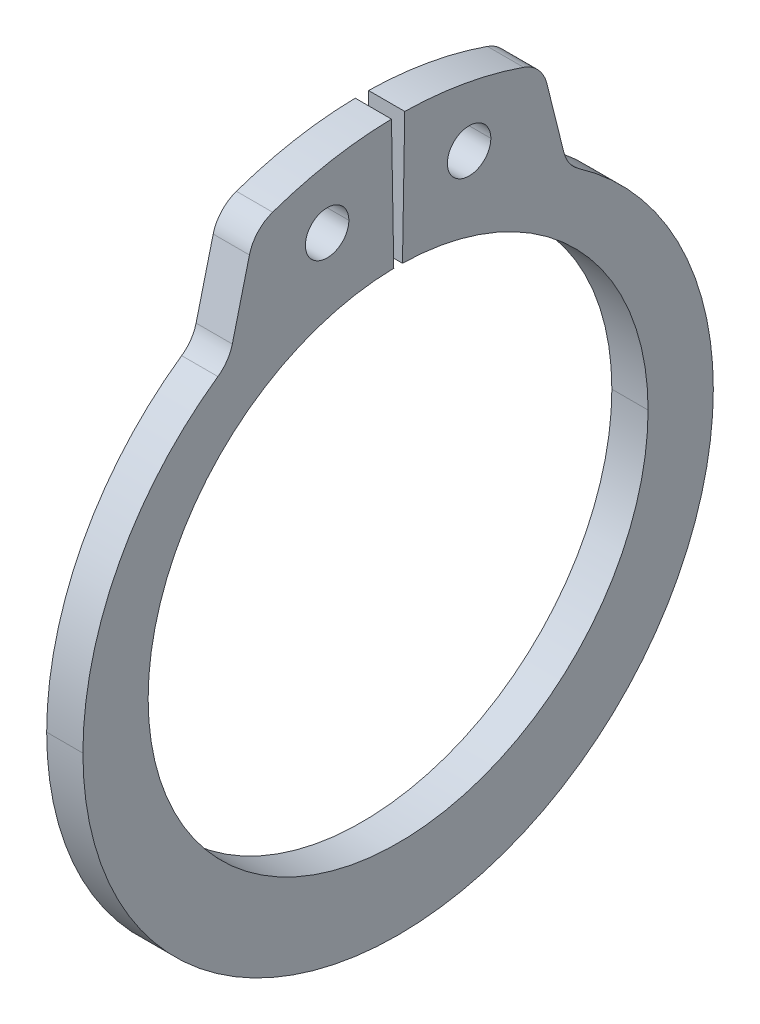
ISO-10303-21;
HEADER;
FILE_DESCRIPTION(('STEP AP214'),'2;1');
FILE_NAME('part.step','',(''),(''),'','','');
FILE_SCHEMA(('AUTOMOTIVE_DESIGN { 1 0 10303 214 1 1 1 1 }'));
ENDSEC;
DATA;
#1=APPLICATION_CONTEXT('core data for automotive mechanical design processes');
#2=APPLICATION_PROTOCOL_DEFINITION('international standard','automotive_design',2000,#1);
#3=PRODUCT_CONTEXT('',#1,'mechanical');
#4=PRODUCT('Part','Part','',(#3));
#5=PRODUCT_RELATED_PRODUCT_CATEGORY('part','',(#4));
#6=PRODUCT_DEFINITION_FORMATION('','',#4);
#7=PRODUCT_DEFINITION_CONTEXT('part definition',#1,'design');
#8=PRODUCT_DEFINITION('design','',#6,#7);
#9=PRODUCT_DEFINITION_SHAPE('','',#8);
#10=(LENGTH_UNIT() NAMED_UNIT(*) SI_UNIT(.MILLI.,.METRE.));
#11=(NAMED_UNIT(*) PLANE_ANGLE_UNIT() SI_UNIT($,.RADIAN.));
#12=(NAMED_UNIT(*) SI_UNIT($,.STERADIAN.) SOLID_ANGLE_UNIT());
#13=UNCERTAINTY_MEASURE_WITH_UNIT(LENGTH_MEASURE(1.E-05),#10,'distance_accuracy_value','');
#14=(GEOMETRIC_REPRESENTATION_CONTEXT(3) GLOBAL_UNCERTAINTY_ASSIGNED_CONTEXT((#13)) GLOBAL_UNIT_ASSIGNED_CONTEXT((#10,
#11,#12)) REPRESENTATION_CONTEXT('',''));
#15=CARTESIAN_POINT('',(0.,0.,0.));
#16=DIRECTION('',(0.,0.,1.));
#17=DIRECTION('',(1.,0.,0.));
#18=AXIS2_PLACEMENT_3D('',#15,#16,#17);
#19=CARTESIAN_POINT('',(0.5,7.55953720484558,-5.54645551751436));
#20=DIRECTION('',(-1.,0.,0.));
#21=DIRECTION('',(0.,0.,1.));
#22=AXIS2_PLACEMENT_3D('',#19,#20,#21);
#23=CYLINDRICAL_SURFACE('',#22,1.);
#24=CARTESIAN_POINT('',(0.5,7.55953720484558,-5.54645551751436));
#25=DIRECTION('',(-1.,0.,0.));
#26=DIRECTION('',(0.,0.,-1.));
#27=AXIS2_PLACEMENT_3D('',#24,#25,#26);
#28=CIRCLE('',#27,1.);
#29=CARTESIAN_POINT('',(0.5,6.73911195964233,-4.97470170945253));
#30=VERTEX_POINT('',#29);
#31=CARTESIAN_POINT('',(0.5,7.31761530924591,-4.57615979123836));
#32=VERTEX_POINT('',#31);
#33=EDGE_CURVE('E221',#30,#32,#28,.T.);
#34=ORIENTED_EDGE('',*,*,#33,.F.);
#35=DIRECTION('',(1.,0.,0.));
#36=VECTOR('',#35,1.);
#37=CARTESIAN_POINT('',(0.5,6.73911195964233,-4.97470170945253));
#38=LINE('',#37,#36);
#39=CARTESIAN_POINT('',(-0.5,6.73911195964233,-4.97470170945253));
#40=VERTEX_POINT('',#39);
#41=EDGE_CURVE('E243',#40,#30,#38,.T.);
#42=ORIENTED_EDGE('',*,*,#41,.F.);
#43=CARTESIAN_POINT('',(-0.5,7.55953720484558,-5.54645551751436));
#44=DIRECTION('',(1.,0.,0.));
#45=DIRECTION('',(0.,0.,-1.));
#46=AXIS2_PLACEMENT_3D('',#43,#44,#45);
#47=CIRCLE('',#46,1.);
#48=CARTESIAN_POINT('',(-0.5,7.31761530924591,-4.57615979123836));
#49=VERTEX_POINT('',#48);
#50=EDGE_CURVE('E269',#49,#40,#47,.T.);
#51=ORIENTED_EDGE('',*,*,#50,.F.);
#52=DIRECTION('',(-1.,0.,0.));
#53=VECTOR('',#52,1.);
#54=CARTESIAN_POINT('',(-0.5,7.31761530924591,-4.57615979123836));
#55=LINE('',#54,#53);
#56=EDGE_CURVE('E188',#32,#49,#55,.T.);
#57=ORIENTED_EDGE('',*,*,#56,.F.);
#58=EDGE_LOOP('',(#34,#42,#51,#57));
#59=FACE_BOUND('',#58,.T.);
#60=ADVANCED_FACE('F16',(#59),#23,.F.);
#61=CARTESIAN_POINT('',(0.5,8.96816184312502,-3.13401869099666));
#62=DIRECTION('',(-1.,0.,0.));
#63=DIRECTION('',(0.,0.,1.));
#64=AXIS2_PLACEMENT_3D('',#61,#62,#63);
#65=CYLINDRICAL_SURFACE('',#64,1.);
#66=CARTESIAN_POINT('',(0.5,8.96816184312502,-3.13401869099666));
#67=DIRECTION('',(1.,0.,0.));
#68=DIRECTION('',(0.,0.,-1.));
#69=AXIS2_PLACEMENT_3D('',#66,#67,#68);
#70=CIRCLE('',#69,1.);
#71=CARTESIAN_POINT('',(0.5,9.21008373872469,-4.10431441727265));
#72=VERTEX_POINT('',#71);
#73=CARTESIAN_POINT('',(0.5,9.91217887924345,-3.46391539531209));
#74=VERTEX_POINT('',#73);
#75=EDGE_CURVE('E210',#72,#74,#70,.T.);
#76=ORIENTED_EDGE('',*,*,#75,.F.);
#77=DIRECTION('',(1.,0.,0.));
#78=VECTOR('',#77,1.);
#79=CARTESIAN_POINT('',(0.5,9.21008373872469,-4.10431441727265));
#80=LINE('',#79,#78);
#81=CARTESIAN_POINT('',(-0.5,9.21008373872469,-4.10431441727265));
#82=VERTEX_POINT('',#81);
#83=EDGE_CURVE('E196',#82,#72,#80,.T.);
#84=ORIENTED_EDGE('',*,*,#83,.F.);
#85=CARTESIAN_POINT('',(-0.5,8.96816184312502,-3.13401869099666));
#86=DIRECTION('',(-1.,0.,0.));
#87=DIRECTION('',(0.,0.,-1.));
#88=AXIS2_PLACEMENT_3D('',#85,#86,#87);
#89=CIRCLE('',#88,1.);
#90=CARTESIAN_POINT('',(-0.5,9.91217887924345,-3.46391539531209));
#91=VERTEX_POINT('',#90);
#92=EDGE_CURVE('E291',#91,#82,#89,.T.);
#93=ORIENTED_EDGE('',*,*,#92,.F.);
#94=DIRECTION('',(-1.,0.,0.));
#95=VECTOR('',#94,1.);
#96=CARTESIAN_POINT('',(0.5,9.91217887924345,-3.46391539531209));
#97=LINE('',#96,#95);
#98=EDGE_CURVE('E27',#74,#91,#97,.T.);
#99=ORIENTED_EDGE('',*,*,#98,.F.);
#100=EDGE_LOOP('',(#76,#84,#93,#99));
#101=FACE_BOUND('',#100,.T.);
#102=ADVANCED_FACE('F211',(#101),#65,.T.);
#103=CARTESIAN_POINT('',(0.5,8.96816184312502,3.13401869099666));
#104=DIRECTION('',(-1.,0.,0.));
#105=DIRECTION('',(0.,0.,1.));
#106=AXIS2_PLACEMENT_3D('',#103,#104,#105);
#107=CYLINDRICAL_SURFACE('',#106,1.);
#108=CARTESIAN_POINT('',(0.5,8.96816184312502,3.13401869099666));
#109=DIRECTION('',(1.,0.,0.));
#110=DIRECTION('',(0.,0.,-1.));
#111=AXIS2_PLACEMENT_3D('',#108,#109,#110);
#112=CIRCLE('',#111,1.);
#113=CARTESIAN_POINT('',(0.5,9.91217887924345,3.46391539531209));
#114=VERTEX_POINT('',#113);
#115=CARTESIAN_POINT('',(0.5,9.21008373872469,4.10431441727265));
#116=VERTEX_POINT('',#115);
#117=EDGE_CURVE('E320',#114,#116,#112,.T.);
#118=ORIENTED_EDGE('',*,*,#117,.F.);
#119=DIRECTION('',(1.,0.,0.));
#120=VECTOR('',#119,1.);
#121=CARTESIAN_POINT('',(0.5,9.91217887924345,3.46391539531209));
#122=LINE('',#121,#120);
#123=CARTESIAN_POINT('',(-0.5,9.91217887924345,3.46391539531209));
#124=VERTEX_POINT('',#123);
#125=EDGE_CURVE('E337',#124,#114,#122,.T.);
#126=ORIENTED_EDGE('',*,*,#125,.F.);
#127=CARTESIAN_POINT('',(-0.5,8.96816184312502,3.13401869099666));
#128=DIRECTION('',(-1.,0.,0.));
#129=DIRECTION('',(0.,0.,-1.));
#130=AXIS2_PLACEMENT_3D('',#127,#128,#129);
#131=CIRCLE('',#130,1.);
#132=CARTESIAN_POINT('',(-0.5,9.21008373872469,4.10431441727265));
#133=VERTEX_POINT('',#132);
#134=EDGE_CURVE('E386',#133,#124,#131,.T.);
#135=ORIENTED_EDGE('',*,*,#134,.F.);
#136=DIRECTION('',(-1.,0.,0.));
#137=VECTOR('',#136,1.);
#138=CARTESIAN_POINT('',(0.5,9.21008373872469,4.10431441727265));
#139=LINE('',#138,#137);
#140=EDGE_CURVE('E311',#116,#133,#139,.T.);
#141=ORIENTED_EDGE('',*,*,#140,.F.);
#142=EDGE_LOOP('',(#118,#126,#135,#141));
#143=FACE_BOUND('',#142,.T.);
#144=ADVANCED_FACE('F610',(#143),#107,.T.);
#145=CARTESIAN_POINT('',(0.5,7.55953720484558,5.54645551751436));
#146=DIRECTION('',(-1.,0.,0.));
#147=DIRECTION('',(0.,0.,1.));
#148=AXIS2_PLACEMENT_3D('',#145,#146,#147);
#149=CYLINDRICAL_SURFACE('',#148,1.);
#150=CARTESIAN_POINT('',(0.5,7.55953720484558,5.54645551751436));
#151=DIRECTION('',(-1.,0.,0.));
#152=DIRECTION('',(0.,0.,-1.));
#153=AXIS2_PLACEMENT_3D('',#150,#151,#152);
#154=CIRCLE('',#153,1.);
#155=CARTESIAN_POINT('',(0.5,7.31761530924591,4.57615979123836));
#156=VERTEX_POINT('',#155);
#157=CARTESIAN_POINT('',(0.5,6.73911195964233,4.97470170945253));
#158=VERTEX_POINT('',#157);
#159=EDGE_CURVE('E260',#156,#158,#154,.T.);
#160=ORIENTED_EDGE('',*,*,#159,.F.);
#161=DIRECTION('',(1.,0.,0.));
#162=VECTOR('',#161,1.);
#163=CARTESIAN_POINT('',(0.5,7.31761530924591,4.57615979123836));
#164=LINE('',#163,#162);
#165=CARTESIAN_POINT('',(-0.5,7.31761530924591,4.57615979123836));
#166=VERTEX_POINT('',#165);
#167=EDGE_CURVE('E314',#166,#156,#164,.T.);
#168=ORIENTED_EDGE('',*,*,#167,.F.);
#169=CARTESIAN_POINT('',(-0.5,7.55953720484558,5.54645551751436));
#170=DIRECTION('',(1.,0.,0.));
#171=DIRECTION('',(0.,0.,-1.));
#172=AXIS2_PLACEMENT_3D('',#169,#170,#171);
#173=CIRCLE('',#172,1.);
#174=CARTESIAN_POINT('',(-0.5,6.73911195964233,4.97470170945253));
#175=VERTEX_POINT('',#174);
#176=EDGE_CURVE('E268',#175,#166,#173,.T.);
#177=ORIENTED_EDGE('',*,*,#176,.F.);
#178=DIRECTION('',(-1.,0.,0.));
#179=VECTOR('',#178,1.);
#180=CARTESIAN_POINT('',(0.5,6.73911195964233,4.97470170945253));
#181=LINE('',#180,#179);
#182=EDGE_CURVE('E42',#158,#175,#181,.T.);
#183=ORIENTED_EDGE('',*,*,#182,.F.);
#184=EDGE_LOOP('',(#160,#168,#177,#183));
#185=FACE_BOUND('',#184,.T.);
#186=ADVANCED_FACE('F18',(#185),#149,.F.);
#187=CARTESIAN_POINT('',(0.5,8.66711980549086,-1.9596288316201));
#188=DIRECTION('',(-1.,0.,0.));
#189=DIRECTION('',(0.,0.,1.));
#190=AXIS2_PLACEMENT_3D('',#187,#188,#189);
#191=CYLINDRICAL_SURFACE('',#190,0.6);
#192=DIRECTION('',(-1.,0.,0.));
#193=VECTOR('',#192,1.);
#194=CARTESIAN_POINT('',(0.5,8.66711980549086,-2.5596288316201));
#195=LINE('',#194,#193);
#196=CARTESIAN_POINT('',(0.5,8.66711980549086,-2.5596288316201));
#197=VERTEX_POINT('',#196);
#198=CARTESIAN_POINT('',(-0.5,8.66711980549086,-2.5596288316201));
#199=VERTEX_POINT('',#198);
#200=EDGE_CURVE('E351',#197,#199,#195,.T.);
#201=ORIENTED_EDGE('',*,*,#200,.F.);
#202=CARTESIAN_POINT('',(0.5,8.66711980549086,-1.9596288316201));
#203=DIRECTION('',(1.,0.,0.));
#204=DIRECTION('',(0.,0.,-1.));
#205=AXIS2_PLACEMENT_3D('',#202,#203,#204);
#206=CIRCLE('',#205,0.6);
#207=CARTESIAN_POINT('',(0.5,8.66711980549086,-1.3596288316201));
#208=VERTEX_POINT('',#207);
#209=EDGE_CURVE('E278',#197,#208,#206,.T.);
#210=ORIENTED_EDGE('',*,*,#209,.T.);
#211=DIRECTION('',(-1.,0.,0.));
#212=VECTOR('',#211,1.);
#213=CARTESIAN_POINT('',(0.5,8.66711980549086,-1.3596288316201));
#214=LINE('',#213,#212);
#215=CARTESIAN_POINT('',(-0.5,8.66711980549086,-1.3596288316201));
#216=VERTEX_POINT('',#215);
#217=EDGE_CURVE('E270',#208,#216,#214,.T.);
#218=ORIENTED_EDGE('',*,*,#217,.T.);
#219=CARTESIAN_POINT('',(-0.5,8.66711980549086,-1.9596288316201));
#220=DIRECTION('',(1.,0.,0.));
#221=DIRECTION('',(0.,0.,-1.));
#222=AXIS2_PLACEMENT_3D('',#219,#220,#221);
#223=CIRCLE('',#222,0.6);
#224=EDGE_CURVE('E327',#199,#216,#223,.T.);
#225=ORIENTED_EDGE('',*,*,#224,.F.);
#226=EDGE_LOOP('',(#201,#210,#218,#225));
#227=FACE_BOUND('',#226,.T.);
#228=ADVANCED_FACE('F609',(#227),#191,.F.);
#229=CARTESIAN_POINT('',(0.5,8.66711980549086,1.9596288316201));
#230=DIRECTION('',(-1.,0.,0.));
#231=DIRECTION('',(0.,0.,1.));
#232=AXIS2_PLACEMENT_3D('',#229,#230,#231);
#233=CYLINDRICAL_SURFACE('',#232,0.6);
#234=DIRECTION('',(-1.,0.,0.));
#235=VECTOR('',#234,1.);
#236=CARTESIAN_POINT('',(0.5,8.66711980549086,1.3596288316201));
#237=LINE('',#236,#235);
#238=CARTESIAN_POINT('',(0.5,8.66711980549086,1.3596288316201));
#239=VERTEX_POINT('',#238);
#240=CARTESIAN_POINT('',(-0.5,8.66711980549086,1.3596288316201));
#241=VERTEX_POINT('',#240);
#242=EDGE_CURVE('E347',#239,#241,#237,.T.);
#243=ORIENTED_EDGE('',*,*,#242,.F.);
#244=CARTESIAN_POINT('',(0.5,8.66711980549086,1.9596288316201));
#245=DIRECTION('',(1.,0.,0.));
#246=DIRECTION('',(0.,0.,-1.));
#247=AXIS2_PLACEMENT_3D('',#244,#245,#246);
#248=CIRCLE('',#247,0.6);
#249=CARTESIAN_POINT('',(0.5,8.66711980549086,2.5596288316201));
#250=VERTEX_POINT('',#249);
#251=EDGE_CURVE('E275',#239,#250,#248,.T.);
#252=ORIENTED_EDGE('',*,*,#251,.T.);
#253=DIRECTION('',(-1.,0.,0.));
#254=VECTOR('',#253,1.);
#255=CARTESIAN_POINT('',(0.5,8.66711980549086,2.5596288316201));
#256=LINE('',#255,#254);
#257=CARTESIAN_POINT('',(-0.5,8.66711980549086,2.5596288316201));
#258=VERTEX_POINT('',#257);
#259=EDGE_CURVE('E244',#250,#258,#256,.T.);
#260=ORIENTED_EDGE('',*,*,#259,.T.);
#261=CARTESIAN_POINT('',(-0.5,8.66711980549086,1.9596288316201));
#262=DIRECTION('',(1.,0.,0.));
#263=DIRECTION('',(0.,0.,-1.));
#264=AXIS2_PLACEMENT_3D('',#261,#262,#263);
#265=CIRCLE('',#264,0.6);
#266=EDGE_CURVE('E367',#241,#258,#265,.T.);
#267=ORIENTED_EDGE('',*,*,#266,.F.);
#268=EDGE_LOOP('',(#243,#252,#260,#267));
#269=FACE_BOUND('',#268,.T.);
#270=ADVANCED_FACE('F615',(#269),#233,.F.);
#271=CARTESIAN_POINT('',(0.5,10.4984007991421,-0.183250267591479));
#272=DIRECTION('',(0.,-0.0174524064372841,-0.999847695156391));
#273=DIRECTION('',(0.,-0.999847695156391,0.0174524064372841));
#274=AXIS2_PLACEMENT_3D('',#271,#272,#273);
#275=PLANE('',#274);
#276=DIRECTION('',(0.,-0.999847695156391,0.0174524064372841));
#277=VECTOR('',#276,1.);
#278=CARTESIAN_POINT('',(-0.5,10.4984007991421,-0.183250267591479));
#279=LINE('',#278,#277);
#280=CARTESIAN_POINT('',(-0.5,10.4984007991421,-0.183250267591479));
#281=VERTEX_POINT('',#280);
#282=CARTESIAN_POINT('',(-0.5,6.8989490965791,-0.120421604417256));
#283=VERTEX_POINT('',#282);
#284=EDGE_CURVE('E232',#281,#283,#279,.T.);
#285=ORIENTED_EDGE('',*,*,#284,.T.);
#286=DIRECTION('',(-1.,0.,0.));
#287=VECTOR('',#286,1.);
#288=CARTESIAN_POINT('',(0.5,6.8989490965791,-0.120421604417256));
#289=LINE('',#288,#287);
#290=CARTESIAN_POINT('',(0.5,6.8989490965791,-0.120421604417256));
#291=VERTEX_POINT('',#290);
#292=EDGE_CURVE('E323',#291,#283,#289,.T.);
#293=ORIENTED_EDGE('',*,*,#292,.F.);
#294=DIRECTION('',(0.,-0.999847695156391,0.0174524064372841));
#295=VECTOR('',#294,1.);
#296=CARTESIAN_POINT('',(0.5,10.4984007991421,-0.183250267591479));
#297=LINE('',#296,#295);
#298=CARTESIAN_POINT('',(0.5,10.4984007991421,-0.183250267591479));
#299=VERTEX_POINT('',#298);
#300=EDGE_CURVE('E253',#299,#291,#297,.T.);
#301=ORIENTED_EDGE('',*,*,#300,.F.);
#302=DIRECTION('',(-1.,0.,0.));
#303=VECTOR('',#302,1.);
#304=CARTESIAN_POINT('',(0.5,10.4984007991421,-0.183250267591479));
#305=LINE('',#304,#303);
#306=EDGE_CURVE('E11',#299,#281,#305,.T.);
#307=ORIENTED_EDGE('',*,*,#306,.T.);
#308=EDGE_LOOP('',(#285,#293,#301,#307));
#309=FACE_BOUND('',#308,.T.);
#310=ADVANCED_FACE('F619',(#309),#275,.F.);
#311=CARTESIAN_POINT('',(0.5,0.,0.));
#312=DIRECTION('',(-1.,0.,0.));
#313=DIRECTION('',(0.,0.,1.));
#314=AXIS2_PLACEMENT_3D('',#311,#312,#313);
#315=CYLINDRICAL_SURFACE('',#314,10.5);
#316=CARTESIAN_POINT('',(0.5,0.,0.));
#317=DIRECTION('',(1.,0.,0.));
#318=DIRECTION('',(0.,0.,1.));
#319=AXIS2_PLACEMENT_3D('',#316,#317,#318);
#320=CIRCLE('',#319,10.5);
#321=EDGE_CURVE('E216',#74,#299,#320,.T.);
#322=ORIENTED_EDGE('',*,*,#321,.F.);
#323=ORIENTED_EDGE('',*,*,#98,.T.);
#324=CARTESIAN_POINT('',(-0.5,0.,0.));
#325=DIRECTION('',(1.,0.,0.));
#326=DIRECTION('',(0.,0.,1.));
#327=AXIS2_PLACEMENT_3D('',#324,#325,#326);
#328=CIRCLE('',#327,10.5);
#329=EDGE_CURVE('E287',#91,#281,#328,.T.);
#330=ORIENTED_EDGE('',*,*,#329,.T.);
#331=ORIENTED_EDGE('',*,*,#306,.F.);
#332=EDGE_LOOP('',(#322,#323,#330,#331));
#333=FACE_BOUND('',#332,.T.);
#334=ADVANCED_FACE('F651',(#333),#315,.T.);
#335=CARTESIAN_POINT('',(0.5,9.71734472745919,-3.97784004803122));
#336=DIRECTION('',(0.,-0.241921895599666,0.970295726275997));
#337=DIRECTION('',(-1.,0.,0.));
#338=AXIS2_PLACEMENT_3D('',#335,#336,#337);
#339=PLANE('',#338);
#340=DIRECTION('',(0.,0.970295726275997,0.241921895599666));
#341=VECTOR('',#340,1.);
#342=CARTESIAN_POINT('',(-0.5,9.71734472745919,-3.97784004803122));
#343=LINE('',#342,#341);
#344=EDGE_CURVE('E203',#49,#82,#343,.T.);
#345=ORIENTED_EDGE('',*,*,#344,.T.);
#346=ORIENTED_EDGE('',*,*,#83,.T.);
#347=DIRECTION('',(0.,0.970295726275997,0.241921895599666));
#348=VECTOR('',#347,1.);
#349=CARTESIAN_POINT('',(0.5,9.71734472745919,-3.97784004803122));
#350=LINE('',#349,#348);
#351=EDGE_CURVE('E200',#32,#72,#350,.T.);
#352=ORIENTED_EDGE('',*,*,#351,.F.);
#353=ORIENTED_EDGE('',*,*,#56,.T.);
#354=EDGE_LOOP('',(#345,#346,#352,#353));
#355=FACE_BOUND('',#354,.T.);
#356=ADVANCED_FACE('F198',(#355),#339,.F.);
#357=CARTESIAN_POINT('',(0.5,-0.399224177769538,0.));
#358=DIRECTION('',(-1.,0.,0.));
#359=DIRECTION('',(0.,0.,1.));
#360=AXIS2_PLACEMENT_3D('',#357,#358,#359);
#361=CYLINDRICAL_SURFACE('',#360,8.70077582223046);
#362=DIRECTION('',(-1.,0.,0.));
#363=VECTOR('',#362,1.);
#364=CARTESIAN_POINT('',(0.5,-0.399224177769538,8.70077582223046));
#365=LINE('',#364,#363);
#366=CARTESIAN_POINT('',(0.5,-0.399224177769538,8.70077582223046));
#367=VERTEX_POINT('',#366);
#368=CARTESIAN_POINT('',(-0.5,-0.399224177769538,8.70077582223046));
#369=VERTEX_POINT('',#368);
#370=EDGE_CURVE('E254',#367,#369,#365,.T.);
#371=ORIENTED_EDGE('',*,*,#370,.F.);
#372=CARTESIAN_POINT('',(0.5,-0.399224177769538,0.));
#373=DIRECTION('',(1.,0.,0.));
#374=DIRECTION('',(0.,0.,-1.));
#375=AXIS2_PLACEMENT_3D('',#372,#373,#374);
#376=CIRCLE('',#375,8.70077582223046);
#377=EDGE_CURVE('E228',#158,#367,#376,.T.);
#378=ORIENTED_EDGE('',*,*,#377,.F.);
#379=ORIENTED_EDGE('',*,*,#182,.T.);
#380=CARTESIAN_POINT('',(-0.5,-0.399224177769538,0.));
#381=DIRECTION('',(1.,0.,0.));
#382=DIRECTION('',(0.,0.,-1.));
#383=AXIS2_PLACEMENT_3D('',#380,#381,#382);
#384=CIRCLE('',#383,8.70077582223046);
#385=EDGE_CURVE('E265',#175,#369,#384,.T.);
#386=ORIENTED_EDGE('',*,*,#385,.T.);
#387=EDGE_LOOP('',(#371,#378,#379,#386));
#388=FACE_BOUND('',#387,.T.);
#389=ADVANCED_FACE('F675',(#388),#361,.T.);
#390=CARTESIAN_POINT('',(0.5,9.71734472745919,3.97784004803122));
#391=DIRECTION('',(0.,-0.241921895599665,-0.970295726275997));
#392=DIRECTION('',(0.,-0.970295726275997,0.241921895599665));
#393=AXIS2_PLACEMENT_3D('',#390,#391,#392);
#394=PLANE('',#393);
#395=DIRECTION('',(0.,-0.970295726275997,0.241921895599665));
#396=VECTOR('',#395,1.);
#397=CARTESIAN_POINT('',(-0.5,9.71734472745919,3.97784004803122));
#398=LINE('',#397,#396);
#399=EDGE_CURVE('E358',#133,#166,#398,.T.);
#400=ORIENTED_EDGE('',*,*,#399,.T.);
#401=ORIENTED_EDGE('',*,*,#167,.T.);
#402=DIRECTION('',(0.,-0.970295726275997,0.241921895599665));
#403=VECTOR('',#402,1.);
#404=CARTESIAN_POINT('',(0.5,9.71734472745919,3.97784004803122));
#405=LINE('',#404,#403);
#406=EDGE_CURVE('E264',#116,#156,#405,.T.);
#407=ORIENTED_EDGE('',*,*,#406,.F.);
#408=ORIENTED_EDGE('',*,*,#140,.T.);
#409=EDGE_LOOP('',(#400,#401,#407,#408));
#410=FACE_BOUND('',#409,.T.);
#411=ADVANCED_FACE('F679',(#410),#394,.F.);
#412=CARTESIAN_POINT('',(0.5,0.,0.));
#413=DIRECTION('',(-1.,0.,0.));
#414=DIRECTION('',(0.,0.,1.));
#415=AXIS2_PLACEMENT_3D('',#412,#413,#414);
#416=CYLINDRICAL_SURFACE('',#415,10.5);
#417=CARTESIAN_POINT('',(-0.5,0.,0.));
#418=DIRECTION('',(1.,0.,0.));
#419=DIRECTION('',(0.,0.,-1.));
#420=AXIS2_PLACEMENT_3D('',#417,#418,#419);
#421=CIRCLE('',#420,10.5);
#422=CARTESIAN_POINT('',(-0.5,10.4984007991421,0.183250267591477));
#423=VERTEX_POINT('',#422);
#424=EDGE_CURVE('E362',#423,#124,#421,.T.);
#425=ORIENTED_EDGE('',*,*,#424,.T.);
#426=ORIENTED_EDGE('',*,*,#125,.T.);
#427=CARTESIAN_POINT('',(0.5,0.,0.));
#428=DIRECTION('',(1.,0.,0.));
#429=DIRECTION('',(0.,0.,-1.));
#430=AXIS2_PLACEMENT_3D('',#427,#428,#429);
#431=CIRCLE('',#430,10.5);
#432=CARTESIAN_POINT('',(0.5,10.4984007991421,0.183250267591477));
#433=VERTEX_POINT('',#432);
#434=EDGE_CURVE('E331',#433,#114,#431,.T.);
#435=ORIENTED_EDGE('',*,*,#434,.F.);
#436=DIRECTION('',(-1.,0.,0.));
#437=VECTOR('',#436,1.);
#438=CARTESIAN_POINT('',(0.5,10.4984007991421,0.183250267591477));
#439=LINE('',#438,#437);
#440=EDGE_CURVE('E326',#433,#423,#439,.T.);
#441=ORIENTED_EDGE('',*,*,#440,.T.);
#442=EDGE_LOOP('',(#425,#426,#435,#441));
#443=FACE_BOUND('',#442,.T.);
#444=ADVANCED_FACE('F375',(#443),#416,.T.);
#445=CARTESIAN_POINT('',(0.5,6.8989490965791,0.120421604417256));
#446=DIRECTION('',(0.,-0.0174524064372835,0.999847695156391));
#447=DIRECTION('',(-1.,0.,0.));
#448=AXIS2_PLACEMENT_3D('',#445,#446,#447);
#449=PLANE('',#448);
#450=DIRECTION('',(0.,0.999847695156391,0.0174524064372835));
#451=VECTOR('',#450,1.);
#452=CARTESIAN_POINT('',(-0.5,6.8989490965791,0.120421604417256));
#453=LINE('',#452,#451);
#454=CARTESIAN_POINT('',(-0.5,6.8989490965791,0.120421604417256));
#455=VERTEX_POINT('',#454);
#456=EDGE_CURVE('E343',#455,#423,#453,.T.);
#457=ORIENTED_EDGE('',*,*,#456,.T.);
#458=ORIENTED_EDGE('',*,*,#440,.F.);
#459=DIRECTION('',(0.,0.999847695156391,0.0174524064372835));
#460=VECTOR('',#459,1.);
#461=CARTESIAN_POINT('',(0.5,6.8989490965791,0.120421604417256));
#462=LINE('',#461,#460);
#463=CARTESIAN_POINT('',(0.5,6.8989490965791,0.120421604417256));
#464=VERTEX_POINT('',#463);
#465=EDGE_CURVE('E252',#464,#433,#462,.T.);
#466=ORIENTED_EDGE('',*,*,#465,.F.);
#467=DIRECTION('',(-1.,0.,0.));
#468=VECTOR('',#467,1.);
#469=CARTESIAN_POINT('',(0.5,6.8989490965791,0.120421604417256));
#470=LINE('',#469,#468);
#471=EDGE_CURVE('E299',#464,#455,#470,.T.);
#472=ORIENTED_EDGE('',*,*,#471,.T.);
#473=EDGE_LOOP('',(#457,#458,#466,#472));
#474=FACE_BOUND('',#473,.T.);
#475=ADVANCED_FACE('F380',(#474),#449,.F.);
#476=CARTESIAN_POINT('',(0.5,0.,0.));
#477=DIRECTION('',(-1.,0.,0.));
#478=DIRECTION('',(0.,0.,1.));
#479=AXIS2_PLACEMENT_3D('',#476,#477,#478);
#480=CYLINDRICAL_SURFACE('',#479,6.9);
#481=DIRECTION('',(-1.,0.,0.));
#482=VECTOR('',#481,1.);
#483=CARTESIAN_POINT('',(0.5,0.,-6.9));
#484=LINE('',#483,#482);
#485=CARTESIAN_POINT('',(0.5,0.,-6.9));
#486=VERTEX_POINT('',#485);
#487=CARTESIAN_POINT('',(-0.5,0.,-6.9));
#488=VERTEX_POINT('',#487);
#489=EDGE_CURVE('E281',#486,#488,#484,.T.);
#490=ORIENTED_EDGE('',*,*,#489,.F.);
#491=CARTESIAN_POINT('',(0.5,0.,0.));
#492=DIRECTION('',(-1.,0.,0.));
#493=DIRECTION('',(0.,0.,-1.));
#494=AXIS2_PLACEMENT_3D('',#491,#492,#493);
#495=CIRCLE('',#494,6.9);
#496=EDGE_CURVE('E249',#291,#486,#495,.T.);
#497=ORIENTED_EDGE('',*,*,#496,.F.);
#498=ORIENTED_EDGE('',*,*,#292,.T.);
#499=CARTESIAN_POINT('',(-0.5,0.,0.));
#500=DIRECTION('',(-1.,0.,0.));
#501=DIRECTION('',(0.,0.,-1.));
#502=AXIS2_PLACEMENT_3D('',#499,#500,#501);
#503=CIRCLE('',#502,6.9);
#504=EDGE_CURVE('E340',#283,#488,#503,.T.);
#505=ORIENTED_EDGE('',*,*,#504,.T.);
#506=EDGE_LOOP('',(#490,#497,#498,#505));
#507=FACE_BOUND('',#506,.T.);
#508=ADVANCED_FACE('F627',(#507),#480,.F.);
#509=CARTESIAN_POINT('',(-0.5,0.,0.));
#510=DIRECTION('',(1.,0.,0.));
#511=DIRECTION('',(0.,1.,0.));
#512=AXIS2_PLACEMENT_3D('',#509,#510,#511);
#513=PLANE('',#512);
#514=CARTESIAN_POINT('',(-0.5,8.66711980549086,-1.9596288316201));
#515=DIRECTION('',(1.,0.,0.));
#516=DIRECTION('',(0.,0.,-1.));
#517=AXIS2_PLACEMENT_3D('',#514,#515,#516);
#518=CIRCLE('',#517,0.6);
#519=EDGE_CURVE('E274',#216,#199,#518,.T.);
#520=ORIENTED_EDGE('',*,*,#519,.T.);
#521=ORIENTED_EDGE('',*,*,#224,.T.);
#522=EDGE_LOOP('',(#520,#521));
#523=FACE_BOUND('',#522,.T.);
#524=CARTESIAN_POINT('',(-0.5,8.66711980549086,1.9596288316201));
#525=DIRECTION('',(1.,0.,0.));
#526=DIRECTION('',(0.,0.,-1.));
#527=AXIS2_PLACEMENT_3D('',#524,#525,#526);
#528=CIRCLE('',#527,0.6);
#529=EDGE_CURVE('E248',#258,#241,#528,.T.);
#530=ORIENTED_EDGE('',*,*,#529,.T.);
#531=ORIENTED_EDGE('',*,*,#266,.T.);
#532=EDGE_LOOP('',(#530,#531));
#533=FACE_BOUND('',#532,.T.);
#534=ORIENTED_EDGE('',*,*,#399,.F.);
#535=ORIENTED_EDGE('',*,*,#134,.T.);
#536=ORIENTED_EDGE('',*,*,#424,.F.);
#537=ORIENTED_EDGE('',*,*,#456,.F.);
#538=CARTESIAN_POINT('',(-0.5,0.,0.));
#539=DIRECTION('',(-1.,0.,0.));
#540=DIRECTION('',(0.,0.,-1.));
#541=AXIS2_PLACEMENT_3D('',#538,#539,#540);
#542=CIRCLE('',#541,6.9);
#543=CARTESIAN_POINT('',(-0.5,0.,6.9));
#544=VERTEX_POINT('',#543);
#545=EDGE_CURVE('E295',#544,#455,#542,.T.);
#546=ORIENTED_EDGE('',*,*,#545,.F.);
#547=CARTESIAN_POINT('',(-0.5,0.,0.));
#548=DIRECTION('',(-1.,0.,0.));
#549=DIRECTION('',(0.,0.,-1.));
#550=AXIS2_PLACEMENT_3D('',#547,#548,#549);
#551=CIRCLE('',#550,6.9);
#552=EDGE_CURVE('E285',#488,#544,#551,.T.);
#553=ORIENTED_EDGE('',*,*,#552,.F.);
#554=ORIENTED_EDGE('',*,*,#504,.F.);
#555=ORIENTED_EDGE('',*,*,#284,.F.);
#556=ORIENTED_EDGE('',*,*,#329,.F.);
#557=ORIENTED_EDGE('',*,*,#92,.T.);
#558=ORIENTED_EDGE('',*,*,#344,.F.);
#559=ORIENTED_EDGE('',*,*,#50,.T.);
#560=CARTESIAN_POINT('',(-0.5,-0.399224177769538,0.));
#561=DIRECTION('',(1.,0.,0.));
#562=DIRECTION('',(0.,0.,-1.));
#563=AXIS2_PLACEMENT_3D('',#560,#561,#562);
#564=CIRCLE('',#563,8.70077582223046);
#565=CARTESIAN_POINT('',(-0.5,-0.399224177769537,-8.70077582223046));
#566=VERTEX_POINT('',#565);
#567=EDGE_CURVE('E238',#566,#40,#564,.T.);
#568=ORIENTED_EDGE('',*,*,#567,.F.);
#569=CARTESIAN_POINT('',(-0.5,-0.399224177769538,0.));
#570=DIRECTION('',(1.,0.,0.));
#571=DIRECTION('',(0.,0.,-1.));
#572=AXIS2_PLACEMENT_3D('',#569,#570,#571);
#573=CIRCLE('',#572,8.70077582223046);
#574=EDGE_CURVE('E258',#369,#566,#573,.T.);
#575=ORIENTED_EDGE('',*,*,#574,.F.);
#576=ORIENTED_EDGE('',*,*,#385,.F.);
#577=ORIENTED_EDGE('',*,*,#176,.T.);
#578=EDGE_LOOP('',(#534,#535,#536,#537,#546,#553,#554,#555,#556,#557,#558,#559,#568,#575,#576,#577));
#579=FACE_BOUND('',#578,.T.);
#580=ADVANCED_FACE('F384',(#523,#533,#579),#513,.F.);
#581=CARTESIAN_POINT('',(0.5,0.,0.));
#582=DIRECTION('',(1.,0.,0.));
#583=DIRECTION('',(0.,1.,0.));
#584=AXIS2_PLACEMENT_3D('',#581,#582,#583);
#585=PLANE('',#584);
#586=CARTESIAN_POINT('',(0.5,8.66711980549086,-1.9596288316201));
#587=DIRECTION('',(1.,0.,0.));
#588=DIRECTION('',(0.,0.,-1.));
#589=AXIS2_PLACEMENT_3D('',#586,#587,#588);
#590=CIRCLE('',#589,0.6);
#591=EDGE_CURVE('E355',#208,#197,#590,.T.);
#592=ORIENTED_EDGE('',*,*,#591,.F.);
#593=ORIENTED_EDGE('',*,*,#209,.F.);
#594=EDGE_LOOP('',(#592,#593));
#595=FACE_BOUND('',#594,.T.);
#596=CARTESIAN_POINT('',(0.5,8.66711980549086,1.9596288316201));
#597=DIRECTION('',(1.,0.,0.));
#598=DIRECTION('',(0.,0.,-1.));
#599=AXIS2_PLACEMENT_3D('',#596,#597,#598);
#600=CIRCLE('',#599,0.6);
#601=EDGE_CURVE('E20',#250,#239,#600,.T.);
#602=ORIENTED_EDGE('',*,*,#601,.F.);
#603=ORIENTED_EDGE('',*,*,#251,.F.);
#604=EDGE_LOOP('',(#602,#603));
#605=FACE_BOUND('',#604,.T.);
#606=ORIENTED_EDGE('',*,*,#434,.T.);
#607=ORIENTED_EDGE('',*,*,#117,.T.);
#608=ORIENTED_EDGE('',*,*,#406,.T.);
#609=ORIENTED_EDGE('',*,*,#159,.T.);
#610=ORIENTED_EDGE('',*,*,#377,.T.);
#611=CARTESIAN_POINT('',(0.5,-0.399224177769538,0.));
#612=DIRECTION('',(1.,0.,0.));
#613=DIRECTION('',(0.,0.,-1.));
#614=AXIS2_PLACEMENT_3D('',#611,#612,#613);
#615=CIRCLE('',#614,8.70077582223046);
#616=CARTESIAN_POINT('',(0.5,-0.399224177769537,-8.70077582223046));
#617=VERTEX_POINT('',#616);
#618=EDGE_CURVE('E259',#367,#617,#615,.T.);
#619=ORIENTED_EDGE('',*,*,#618,.T.);
#620=CARTESIAN_POINT('',(0.5,-0.399224177769538,0.));
#621=DIRECTION('',(1.,0.,0.));
#622=DIRECTION('',(0.,0.,-1.));
#623=AXIS2_PLACEMENT_3D('',#620,#621,#622);
#624=CIRCLE('',#623,8.70077582223046);
#625=EDGE_CURVE('E239',#617,#30,#624,.T.);
#626=ORIENTED_EDGE('',*,*,#625,.T.);
#627=ORIENTED_EDGE('',*,*,#33,.T.);
#628=ORIENTED_EDGE('',*,*,#351,.T.);
#629=ORIENTED_EDGE('',*,*,#75,.T.);
#630=ORIENTED_EDGE('',*,*,#321,.T.);
#631=ORIENTED_EDGE('',*,*,#300,.T.);
#632=ORIENTED_EDGE('',*,*,#496,.T.);
#633=CARTESIAN_POINT('',(0.5,0.,0.));
#634=DIRECTION('',(-1.,0.,0.));
#635=DIRECTION('',(0.,0.,-1.));
#636=AXIS2_PLACEMENT_3D('',#633,#634,#635);
#637=CIRCLE('',#636,6.9);
#638=CARTESIAN_POINT('',(0.5,0.,6.9));
#639=VERTEX_POINT('',#638);
#640=EDGE_CURVE('E286',#486,#639,#637,.T.);
#641=ORIENTED_EDGE('',*,*,#640,.T.);
#642=CARTESIAN_POINT('',(0.5,0.,0.));
#643=DIRECTION('',(-1.,0.,0.));
#644=DIRECTION('',(0.,0.,-1.));
#645=AXIS2_PLACEMENT_3D('',#642,#643,#644);
#646=CIRCLE('',#645,6.9);
#647=EDGE_CURVE('E300',#639,#464,#646,.T.);
#648=ORIENTED_EDGE('',*,*,#647,.T.);
#649=ORIENTED_EDGE('',*,*,#465,.T.);
#650=EDGE_LOOP('',(#606,#607,#608,#609,#610,#619,#626,#627,#628,#629,#630,#631,#632,#641,#648,#649));
#651=FACE_BOUND('',#650,.T.);
#652=ADVANCED_FACE('F219',(#595,#605,#651),#585,.T.);
#653=CARTESIAN_POINT('',(0.5,0.,0.));
#654=DIRECTION('',(-1.,0.,0.));
#655=DIRECTION('',(0.,0.,1.));
#656=AXIS2_PLACEMENT_3D('',#653,#654,#655);
#657=CYLINDRICAL_SURFACE('',#656,6.9);
#658=ORIENTED_EDGE('',*,*,#647,.F.);
#659=DIRECTION('',(-1.,0.,0.));
#660=VECTOR('',#659,1.);
#661=CARTESIAN_POINT('',(0.5,0.,6.9));
#662=LINE('',#661,#660);
#663=EDGE_CURVE('E301',#639,#544,#662,.T.);
#664=ORIENTED_EDGE('',*,*,#663,.T.);
#665=ORIENTED_EDGE('',*,*,#545,.T.);
#666=ORIENTED_EDGE('',*,*,#471,.F.);
#667=EDGE_LOOP('',(#658,#664,#665,#666));
#668=FACE_BOUND('',#667,.T.);
#669=ADVANCED_FACE('F689',(#668),#657,.F.);
#670=CARTESIAN_POINT('',(0.5,0.,0.));
#671=DIRECTION('',(-1.,0.,0.));
#672=DIRECTION('',(0.,0.,1.));
#673=AXIS2_PLACEMENT_3D('',#670,#671,#672);
#674=CYLINDRICAL_SURFACE('',#673,6.9);
#675=ORIENTED_EDGE('',*,*,#640,.F.);
#676=ORIENTED_EDGE('',*,*,#489,.T.);
#677=ORIENTED_EDGE('',*,*,#552,.T.);
#678=ORIENTED_EDGE('',*,*,#663,.F.);
#679=EDGE_LOOP('',(#675,#676,#677,#678));
#680=FACE_BOUND('',#679,.T.);
#681=ADVANCED_FACE('F684',(#680),#674,.F.);
#682=CARTESIAN_POINT('',(0.5,-0.399224177769538,0.));
#683=DIRECTION('',(-1.,0.,0.));
#684=DIRECTION('',(0.,0.,1.));
#685=AXIS2_PLACEMENT_3D('',#682,#683,#684);
#686=CYLINDRICAL_SURFACE('',#685,8.70077582223046);
#687=DIRECTION('',(-1.,0.,0.));
#688=VECTOR('',#687,1.);
#689=CARTESIAN_POINT('',(0.5,-0.399224177769537,-8.70077582223046));
#690=LINE('',#689,#688);
#691=EDGE_CURVE('E234',#617,#566,#690,.T.);
#692=ORIENTED_EDGE('',*,*,#691,.F.);
#693=ORIENTED_EDGE('',*,*,#618,.F.);
#694=ORIENTED_EDGE('',*,*,#370,.T.);
#695=ORIENTED_EDGE('',*,*,#574,.T.);
#696=EDGE_LOOP('',(#692,#693,#694,#695));
#697=FACE_BOUND('',#696,.T.);
#698=ADVANCED_FACE('F688',(#697),#686,.T.);
#699=CARTESIAN_POINT('',(0.5,-0.399224177769538,0.));
#700=DIRECTION('',(-1.,0.,0.));
#701=DIRECTION('',(0.,0.,1.));
#702=AXIS2_PLACEMENT_3D('',#699,#700,#701);
#703=CYLINDRICAL_SURFACE('',#702,8.70077582223046);
#704=ORIENTED_EDGE('',*,*,#625,.F.);
#705=ORIENTED_EDGE('',*,*,#691,.T.);
#706=ORIENTED_EDGE('',*,*,#567,.T.);
#707=ORIENTED_EDGE('',*,*,#41,.T.);
#708=EDGE_LOOP('',(#704,#705,#706,#707));
#709=FACE_BOUND('',#708,.T.);
#710=ADVANCED_FACE('F440',(#709),#703,.T.);
#711=CARTESIAN_POINT('',(0.5,8.66711980549086,1.9596288316201));
#712=DIRECTION('',(-1.,0.,0.));
#713=DIRECTION('',(0.,0.,1.));
#714=AXIS2_PLACEMENT_3D('',#711,#712,#713);
#715=CYLINDRICAL_SURFACE('',#714,0.6);
#716=ORIENTED_EDGE('',*,*,#601,.T.);
#717=ORIENTED_EDGE('',*,*,#242,.T.);
#718=ORIENTED_EDGE('',*,*,#529,.F.);
#719=ORIENTED_EDGE('',*,*,#259,.F.);
#720=EDGE_LOOP('',(#716,#717,#718,#719));
#721=FACE_BOUND('',#720,.T.);
#722=ADVANCED_FACE('F633',(#721),#715,.F.);
#723=CARTESIAN_POINT('',(0.5,8.66711980549086,-1.9596288316201));
#724=DIRECTION('',(-1.,0.,0.));
#725=DIRECTION('',(0.,0.,1.));
#726=AXIS2_PLACEMENT_3D('',#723,#724,#725);
#727=CYLINDRICAL_SURFACE('',#726,0.6);
#728=ORIENTED_EDGE('',*,*,#591,.T.);
#729=ORIENTED_EDGE('',*,*,#200,.T.);
#730=ORIENTED_EDGE('',*,*,#519,.F.);
#731=ORIENTED_EDGE('',*,*,#217,.F.);
#732=EDGE_LOOP('',(#728,#729,#730,#731));
#733=FACE_BOUND('',#732,.T.);
#734=ADVANCED_FACE('F637',(#733),#727,.F.);
#735=CLOSED_SHELL('',(#60,#102,#144,#186,#228,#270,#310,#334,#356,#389,#411,#444,#475,#508,#580,
#652,#669,#681,#698,#710,#722,#734));
#736=MANIFOLD_SOLID_BREP('B1',#735);
#737=ADVANCED_BREP_SHAPE_REPRESENTATION('',(#18,#736),#14);
#738=SHAPE_DEFINITION_REPRESENTATION(#9,#737);
ENDSEC;
END-ISO-10303-21;
